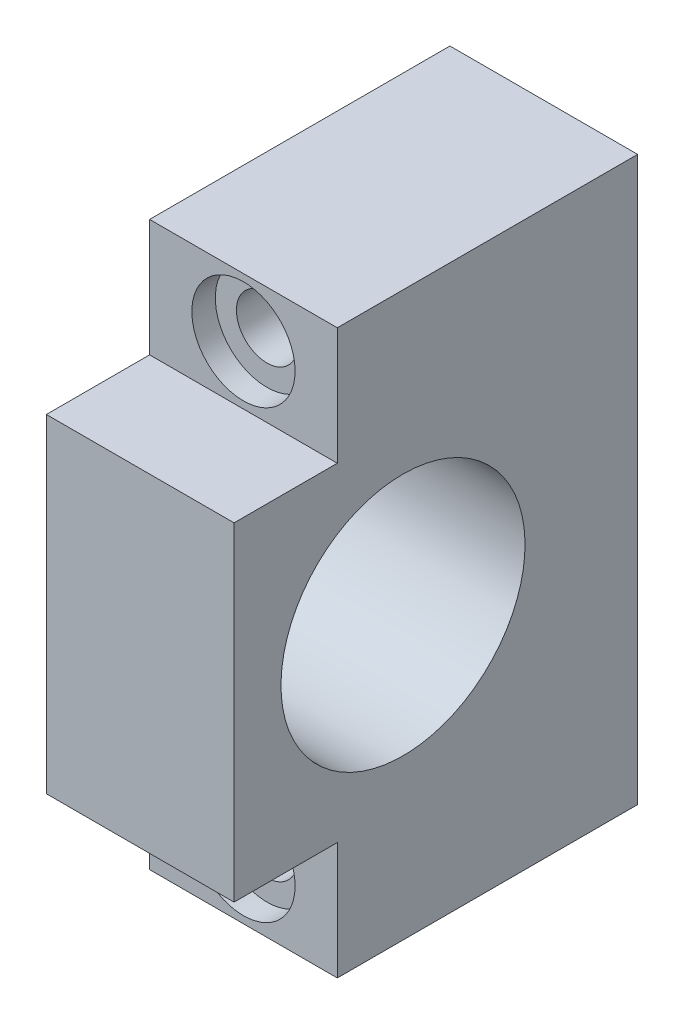
ISO-10303-21;
HEADER;
FILE_DESCRIPTION(('STEP AP214'),'2;1');
FILE_NAME('part.step','',(''),(''),'','','');
FILE_SCHEMA(('AUTOMOTIVE_DESIGN { 1 0 10303 214 1 1 1 1 }'));
ENDSEC;
DATA;
#1=APPLICATION_CONTEXT('core data for automotive mechanical design processes');
#2=APPLICATION_PROTOCOL_DEFINITION('international standard','automotive_design',2000,#1);
#3=PRODUCT_CONTEXT('',#1,'mechanical');
#4=PRODUCT('Part','Part','',(#3));
#5=PRODUCT_RELATED_PRODUCT_CATEGORY('part','',(#4));
#6=PRODUCT_DEFINITION_FORMATION('','',#4);
#7=PRODUCT_DEFINITION_CONTEXT('part definition',#1,'design');
#8=PRODUCT_DEFINITION('design','',#6,#7);
#9=PRODUCT_DEFINITION_SHAPE('','',#8);
#10=(LENGTH_UNIT() NAMED_UNIT(*) SI_UNIT(.MILLI.,.METRE.));
#11=(NAMED_UNIT(*) PLANE_ANGLE_UNIT() SI_UNIT($,.RADIAN.));
#12=(NAMED_UNIT(*) SI_UNIT($,.STERADIAN.) SOLID_ANGLE_UNIT());
#13=UNCERTAINTY_MEASURE_WITH_UNIT(LENGTH_MEASURE(1.E-05),#10,'distance_accuracy_value','');
#14=(GEOMETRIC_REPRESENTATION_CONTEXT(3) GLOBAL_UNCERTAINTY_ASSIGNED_CONTEXT((#13)) GLOBAL_UNIT_ASSIGNED_CONTEXT((#10,
#11,#12)) REPRESENTATION_CONTEXT('',''));
#15=CARTESIAN_POINT('',(0.,0.,0.));
#16=DIRECTION('',(0.,0.,1.));
#17=DIRECTION('',(1.,0.,0.));
#18=AXIS2_PLACEMENT_3D('',#15,#16,#17);
#19=CARTESIAN_POINT('',(0.,-23.75,0.));
#20=DIRECTION('',(0.,0.,1.));
#21=DIRECTION('',(1.,0.,0.));
#22=AXIS2_PLACEMENT_3D('',#19,#20,#21);
#23=CYLINDRICAL_SURFACE('',#22,3.25);
#24=CARTESIAN_POINT('',(0.,-23.75,0.));
#25=DIRECTION('',(0.,0.,1.));
#26=DIRECTION('',(1.,0.,0.));
#27=AXIS2_PLACEMENT_3D('',#24,#25,#26);
#28=CIRCLE('',#27,3.25);
#29=CARTESIAN_POINT('',(3.25,-23.75,0.));
#30=VERTEX_POINT('',#29);
#31=EDGE_CURVE('E178',#30,#30,#28,.T.);
#32=ORIENTED_EDGE('',*,*,#31,.F.);
#33=EDGE_LOOP('',(#32));
#34=FACE_BOUND('',#33,.T.);
#35=CARTESIAN_POINT('',(0.,-23.75,29.5));
#36=DIRECTION('',(0.,0.,1.));
#37=DIRECTION('',(1.,0.,0.));
#38=AXIS2_PLACEMENT_3D('',#35,#36,#37);
#39=CIRCLE('',#38,3.25);
#40=CARTESIAN_POINT('',(3.25,-23.75,29.5));
#41=VERTEX_POINT('',#40);
#42=EDGE_CURVE('E49',#41,#41,#39,.F.);
#43=ORIENTED_EDGE('',*,*,#42,.F.);
#44=EDGE_LOOP('',(#43));
#45=FACE_BOUND('',#44,.T.);
#46=ADVANCED_FACE('F45',(#34,#45),#23,.F.);
#47=CARTESIAN_POINT('',(0.,23.75,0.));
#48=DIRECTION('',(0.,0.,1.));
#49=DIRECTION('',(1.,0.,0.));
#50=AXIS2_PLACEMENT_3D('',#47,#48,#49);
#51=CYLINDRICAL_SURFACE('',#50,3.25);
#52=CARTESIAN_POINT('',(0.,23.75,0.));
#53=DIRECTION('',(0.,0.,1.));
#54=DIRECTION('',(1.,0.,0.));
#55=AXIS2_PLACEMENT_3D('',#52,#53,#54);
#56=CIRCLE('',#55,3.25);
#57=CARTESIAN_POINT('',(3.25,23.75,0.));
#58=VERTEX_POINT('',#57);
#59=EDGE_CURVE('E156',#58,#58,#56,.T.);
#60=ORIENTED_EDGE('',*,*,#59,.F.);
#61=EDGE_LOOP('',(#60));
#62=FACE_BOUND('',#61,.T.);
#63=CARTESIAN_POINT('',(0.,23.75,29.5));
#64=DIRECTION('',(0.,0.,1.));
#65=DIRECTION('',(1.,0.,0.));
#66=AXIS2_PLACEMENT_3D('',#63,#64,#65);
#67=CIRCLE('',#66,3.25);
#68=CARTESIAN_POINT('',(3.25,23.75,29.5));
#69=VERTEX_POINT('',#68);
#70=EDGE_CURVE('E147',#69,#69,#67,.F.);
#71=ORIENTED_EDGE('',*,*,#70,.F.);
#72=EDGE_LOOP('',(#71));
#73=FACE_BOUND('',#72,.T.);
#74=ADVANCED_FACE('F258',(#62,#73),#51,.F.);
#75=CARTESIAN_POINT('',(-10.,30.,43.));
#76=DIRECTION('',(0.,-1.,0.));
#77=DIRECTION('',(0.,0.,-1.));
#78=AXIS2_PLACEMENT_3D('',#75,#76,#77);
#79=PLANE('',#78);
#80=DIRECTION('',(-1.,0.,0.));
#81=VECTOR('',#80,1.);
#82=CARTESIAN_POINT('',(-10.,30.,32.));
#83=LINE('',#82,#81);
#84=CARTESIAN_POINT('',(10.,30.,32.));
#85=VERTEX_POINT('',#84);
#86=CARTESIAN_POINT('',(-10.,30.,32.));
#87=VERTEX_POINT('',#86);
#88=EDGE_CURVE('E201',#85,#87,#83,.T.);
#89=ORIENTED_EDGE('',*,*,#88,.F.);
#90=DIRECTION('',(0.,0.,-1.));
#91=VECTOR('',#90,1.);
#92=CARTESIAN_POINT('',(9.99999999999999,30.,43.));
#93=LINE('',#92,#91);
#94=CARTESIAN_POINT('',(9.99999999999999,30.,0.));
#95=VERTEX_POINT('',#94);
#96=EDGE_CURVE('E11',#85,#95,#93,.T.);
#97=ORIENTED_EDGE('',*,*,#96,.T.);
#98=DIRECTION('',(-1.,0.,0.));
#99=VECTOR('',#98,1.);
#100=CARTESIAN_POINT('',(-10.,30.,0.));
#101=LINE('',#100,#99);
#102=CARTESIAN_POINT('',(-10.,30.,0.));
#103=VERTEX_POINT('',#102);
#104=EDGE_CURVE('E231',#95,#103,#101,.T.);
#105=ORIENTED_EDGE('',*,*,#104,.T.);
#106=DIRECTION('',(0.,0.,-1.));
#107=VECTOR('',#106,1.);
#108=CARTESIAN_POINT('',(-10.,30.,43.));
#109=LINE('',#108,#107);
#110=EDGE_CURVE('E55',#87,#103,#109,.T.);
#111=ORIENTED_EDGE('',*,*,#110,.F.);
#112=EDGE_LOOP('',(#89,#97,#105,#111));
#113=FACE_BOUND('',#112,.T.);
#114=ADVANCED_FACE('F256',(#113),#79,.F.);
#115=CARTESIAN_POINT('',(9.99999999999999,30.,43.));
#116=DIRECTION('',(-1.,0.,0.));
#117=DIRECTION('',(0.,-1.,0.));
#118=AXIS2_PLACEMENT_3D('',#115,#116,#117);
#119=PLANE('',#118);
#120=CARTESIAN_POINT('',(10.,0.,25.));
#121=DIRECTION('',(1.,0.,0.));
#122=DIRECTION('',(0.,1.,0.));
#123=AXIS2_PLACEMENT_3D('',#120,#121,#122);
#124=CIRCLE('',#123,13.);
#125=CARTESIAN_POINT('',(10.,13.,25.));
#126=VERTEX_POINT('',#125);
#127=EDGE_CURVE('E167',#126,#126,#124,.T.);
#128=ORIENTED_EDGE('',*,*,#127,.F.);
#129=EDGE_LOOP('',(#128));
#130=FACE_BOUND('',#129,.T.);
#131=DIRECTION('',(0.,1.,0.));
#132=VECTOR('',#131,1.);
#133=CARTESIAN_POINT('',(9.99999999999999,30.,43.));
#134=LINE('',#133,#132);
#135=CARTESIAN_POINT('',(10.,-17.5,43.));
#136=VERTEX_POINT('',#135);
#137=CARTESIAN_POINT('',(10.,17.5,43.));
#138=VERTEX_POINT('',#137);
#139=EDGE_CURVE('E220',#136,#138,#134,.T.);
#140=ORIENTED_EDGE('',*,*,#139,.F.);
#141=DIRECTION('',(0.,0.,1.));
#142=VECTOR('',#141,1.);
#143=CARTESIAN_POINT('',(10.,-17.5,32.));
#144=LINE('',#143,#142);
#145=CARTESIAN_POINT('',(10.,-17.5,32.));
#146=VERTEX_POINT('',#145);
#147=EDGE_CURVE('E71',#146,#136,#144,.T.);
#148=ORIENTED_EDGE('',*,*,#147,.F.);
#149=DIRECTION('',(0.,1.,0.));
#150=VECTOR('',#149,1.);
#151=CARTESIAN_POINT('',(10.,-30.,32.));
#152=LINE('',#151,#150);
#153=CARTESIAN_POINT('',(10.,-30.,32.));
#154=VERTEX_POINT('',#153);
#155=EDGE_CURVE('E133',#154,#146,#152,.T.);
#156=ORIENTED_EDGE('',*,*,#155,.F.);
#157=DIRECTION('',(0.,0.,-1.));
#158=VECTOR('',#157,1.);
#159=CARTESIAN_POINT('',(10.,-30.,43.));
#160=LINE('',#159,#158);
#161=CARTESIAN_POINT('',(10.,-30.,0.));
#162=VERTEX_POINT('',#161);
#163=EDGE_CURVE('E131',#154,#162,#160,.T.);
#164=ORIENTED_EDGE('',*,*,#163,.T.);
#165=DIRECTION('',(0.,1.,0.));
#166=VECTOR('',#165,1.);
#167=CARTESIAN_POINT('',(9.99999999999999,30.,0.));
#168=LINE('',#167,#166);
#169=EDGE_CURVE('E196',#162,#95,#168,.T.);
#170=ORIENTED_EDGE('',*,*,#169,.T.);
#171=ORIENTED_EDGE('',*,*,#96,.F.);
#172=DIRECTION('',(0.,1.,0.));
#173=VECTOR('',#172,1.);
#174=CARTESIAN_POINT('',(10.,30.,32.));
#175=LINE('',#174,#173);
#176=CARTESIAN_POINT('',(10.,17.5,32.));
#177=VERTEX_POINT('',#176);
#178=EDGE_CURVE('E210',#177,#85,#175,.T.);
#179=ORIENTED_EDGE('',*,*,#178,.F.);
#180=DIRECTION('',(0.,0.,1.));
#181=VECTOR('',#180,1.);
#182=CARTESIAN_POINT('',(10.,17.5,32.));
#183=LINE('',#182,#181);
#184=EDGE_CURVE('E182',#177,#138,#183,.T.);
#185=ORIENTED_EDGE('',*,*,#184,.T.);
#186=EDGE_LOOP('',(#140,#148,#156,#164,#170,#171,#179,#185));
#187=FACE_BOUND('',#186,.T.);
#188=ADVANCED_FACE('F47',(#130,#187),#119,.F.);
#189=CARTESIAN_POINT('',(-10.,30.,43.));
#190=DIRECTION('',(1.,0.,0.));
#191=DIRECTION('',(0.,1.,0.));
#192=AXIS2_PLACEMENT_3D('',#189,#190,#191);
#193=PLANE('',#192);
#194=CARTESIAN_POINT('',(-10.,0.,25.));
#195=DIRECTION('',(1.,0.,0.));
#196=DIRECTION('',(0.,1.,0.));
#197=AXIS2_PLACEMENT_3D('',#194,#195,#196);
#198=CIRCLE('',#197,13.);
#199=CARTESIAN_POINT('',(-10.,13.,25.));
#200=VERTEX_POINT('',#199);
#201=EDGE_CURVE('E177',#200,#200,#198,.T.);
#202=ORIENTED_EDGE('',*,*,#201,.T.);
#203=EDGE_LOOP('',(#202));
#204=FACE_BOUND('',#203,.T.);
#205=DIRECTION('',(0.,-1.,0.));
#206=VECTOR('',#205,1.);
#207=CARTESIAN_POINT('',(-10.,-30.,32.));
#208=LINE('',#207,#206);
#209=CARTESIAN_POINT('',(-10.,-17.5,32.));
#210=VERTEX_POINT('',#209);
#211=CARTESIAN_POINT('',(-10.,-30.,32.));
#212=VERTEX_POINT('',#211);
#213=EDGE_CURVE('E113',#210,#212,#208,.T.);
#214=ORIENTED_EDGE('',*,*,#213,.F.);
#215=DIRECTION('',(0.,0.,1.));
#216=VECTOR('',#215,1.);
#217=CARTESIAN_POINT('',(-10.,-17.5,32.));
#218=LINE('',#217,#216);
#219=CARTESIAN_POINT('',(-10.,-17.5,43.));
#220=VERTEX_POINT('',#219);
#221=EDGE_CURVE('E193',#210,#220,#218,.T.);
#222=ORIENTED_EDGE('',*,*,#221,.T.);
#223=DIRECTION('',(0.,-1.,0.));
#224=VECTOR('',#223,1.);
#225=CARTESIAN_POINT('',(-10.,30.,43.));
#226=LINE('',#225,#224);
#227=CARTESIAN_POINT('',(-10.,17.5,43.));
#228=VERTEX_POINT('',#227);
#229=EDGE_CURVE('E144',#228,#220,#226,.T.);
#230=ORIENTED_EDGE('',*,*,#229,.F.);
#231=DIRECTION('',(0.,0.,1.));
#232=VECTOR('',#231,1.);
#233=CARTESIAN_POINT('',(-10.,17.5,32.));
#234=LINE('',#233,#232);
#235=CARTESIAN_POINT('',(-10.,17.5,32.));
#236=VERTEX_POINT('',#235);
#237=EDGE_CURVE('E63',#236,#228,#234,.T.);
#238=ORIENTED_EDGE('',*,*,#237,.F.);
#239=DIRECTION('',(0.,-1.,0.));
#240=VECTOR('',#239,1.);
#241=CARTESIAN_POINT('',(-10.,30.,32.));
#242=LINE('',#241,#240);
#243=EDGE_CURVE('E207',#87,#236,#242,.T.);
#244=ORIENTED_EDGE('',*,*,#243,.F.);
#245=ORIENTED_EDGE('',*,*,#110,.T.);
#246=DIRECTION('',(0.,-1.,0.));
#247=VECTOR('',#246,1.);
#248=CARTESIAN_POINT('',(-10.,30.,0.));
#249=LINE('',#248,#247);
#250=CARTESIAN_POINT('',(-10.,-30.,0.));
#251=VERTEX_POINT('',#250);
#252=EDGE_CURVE('E137',#103,#251,#249,.T.);
#253=ORIENTED_EDGE('',*,*,#252,.T.);
#254=DIRECTION('',(0.,0.,-1.));
#255=VECTOR('',#254,1.);
#256=CARTESIAN_POINT('',(-10.,-30.,43.));
#257=LINE('',#256,#255);
#258=EDGE_CURVE('E129',#212,#251,#257,.T.);
#259=ORIENTED_EDGE('',*,*,#258,.F.);
#260=EDGE_LOOP('',(#214,#222,#230,#238,#244,#245,#253,#259));
#261=FACE_BOUND('',#260,.T.);
#262=ADVANCED_FACE('F135',(#204,#261),#193,.F.);
#263=CARTESIAN_POINT('',(-10.,-30.,43.));
#264=DIRECTION('',(0.,1.,0.));
#265=DIRECTION('',(0.,0.,1.));
#266=AXIS2_PLACEMENT_3D('',#263,#264,#265);
#267=PLANE('',#266);
#268=ORIENTED_EDGE('',*,*,#163,.F.);
#269=DIRECTION('',(1.,0.,0.));
#270=VECTOR('',#269,1.);
#271=CARTESIAN_POINT('',(-10.,-30.,32.));
#272=LINE('',#271,#270);
#273=EDGE_CURVE('E116',#212,#154,#272,.T.);
#274=ORIENTED_EDGE('',*,*,#273,.F.);
#275=ORIENTED_EDGE('',*,*,#258,.T.);
#276=DIRECTION('',(1.,0.,0.));
#277=VECTOR('',#276,1.);
#278=CARTESIAN_POINT('',(-10.,-30.,0.));
#279=LINE('',#278,#277);
#280=EDGE_CURVE('E224',#251,#162,#279,.T.);
#281=ORIENTED_EDGE('',*,*,#280,.T.);
#282=EDGE_LOOP('',(#268,#274,#275,#281));
#283=FACE_BOUND('',#282,.T.);
#284=ADVANCED_FACE('F127',(#283),#267,.F.);
#285=CARTESIAN_POINT('',(0.,0.,43.));
#286=DIRECTION('',(0.,0.,1.));
#287=DIRECTION('',(1.,0.,0.));
#288=AXIS2_PLACEMENT_3D('',#285,#286,#287);
#289=PLANE('',#288);
#290=DIRECTION('',(-1.,0.,0.));
#291=VECTOR('',#290,1.);
#292=CARTESIAN_POINT('',(-10.,-17.5,43.));
#293=LINE('',#292,#291);
#294=EDGE_CURVE('E123',#136,#220,#293,.T.);
#295=ORIENTED_EDGE('',*,*,#294,.F.);
#296=ORIENTED_EDGE('',*,*,#139,.T.);
#297=DIRECTION('',(1.,0.,0.));
#298=VECTOR('',#297,1.);
#299=CARTESIAN_POINT('',(-10.,17.5,43.));
#300=LINE('',#299,#298);
#301=EDGE_CURVE('E192',#228,#138,#300,.T.);
#302=ORIENTED_EDGE('',*,*,#301,.F.);
#303=ORIENTED_EDGE('',*,*,#229,.T.);
#304=EDGE_LOOP('',(#295,#296,#302,#303));
#305=FACE_BOUND('',#304,.T.);
#306=ADVANCED_FACE('F248',(#305),#289,.T.);
#307=CARTESIAN_POINT('',(0.,0.,0.));
#308=DIRECTION('',(0.,0.,1.));
#309=DIRECTION('',(1.,0.,0.));
#310=AXIS2_PLACEMENT_3D('',#307,#308,#309);
#311=PLANE('',#310);
#312=ORIENTED_EDGE('',*,*,#31,.T.);
#313=EDGE_LOOP('',(#312));
#314=FACE_BOUND('',#313,.T.);
#315=ORIENTED_EDGE('',*,*,#59,.T.);
#316=EDGE_LOOP('',(#315));
#317=FACE_BOUND('',#316,.T.);
#318=ORIENTED_EDGE('',*,*,#169,.F.);
#319=ORIENTED_EDGE('',*,*,#280,.F.);
#320=ORIENTED_EDGE('',*,*,#252,.F.);
#321=ORIENTED_EDGE('',*,*,#104,.F.);
#322=EDGE_LOOP('',(#318,#319,#320,#321));
#323=FACE_BOUND('',#322,.T.);
#324=ADVANCED_FACE('F240',(#314,#317,#323),#311,.F.);
#325=CARTESIAN_POINT('',(-10.,17.5,32.));
#326=DIRECTION('',(0.,-1.,0.));
#327=DIRECTION('',(1.,0.,0.));
#328=AXIS2_PLACEMENT_3D('',#325,#326,#327);
#329=PLANE('',#328);
#330=ORIENTED_EDGE('',*,*,#301,.T.);
#331=ORIENTED_EDGE('',*,*,#184,.F.);
#332=DIRECTION('',(1.,0.,0.));
#333=VECTOR('',#332,1.);
#334=CARTESIAN_POINT('',(-10.,17.5,32.));
#335=LINE('',#334,#333);
#336=EDGE_CURVE('E213',#236,#177,#335,.T.);
#337=ORIENTED_EDGE('',*,*,#336,.F.);
#338=ORIENTED_EDGE('',*,*,#237,.T.);
#339=EDGE_LOOP('',(#330,#331,#337,#338));
#340=FACE_BOUND('',#339,.T.);
#341=ADVANCED_FACE('F249',(#340),#329,.F.);
#342=CARTESIAN_POINT('',(0.,0.,32.));
#343=DIRECTION('',(0.,0.,1.));
#344=DIRECTION('',(1.,0.,0.));
#345=AXIS2_PLACEMENT_3D('',#342,#343,#344);
#346=PLANE('',#345);
#347=CARTESIAN_POINT('',(0.,23.75,32.));
#348=DIRECTION('',(0.,0.,1.));
#349=DIRECTION('',(1.,0.,0.));
#350=AXIS2_PLACEMENT_3D('',#347,#348,#349);
#351=CIRCLE('',#350,5.5);
#352=CARTESIAN_POINT('',(5.5,23.75,32.));
#353=VERTEX_POINT('',#352);
#354=EDGE_CURVE('E164',#353,#353,#351,.T.);
#355=ORIENTED_EDGE('',*,*,#354,.F.);
#356=EDGE_LOOP('',(#355));
#357=FACE_BOUND('',#356,.T.);
#358=ORIENTED_EDGE('',*,*,#243,.T.);
#359=ORIENTED_EDGE('',*,*,#336,.T.);
#360=ORIENTED_EDGE('',*,*,#178,.T.);
#361=ORIENTED_EDGE('',*,*,#88,.T.);
#362=EDGE_LOOP('',(#358,#359,#360,#361));
#363=FACE_BOUND('',#362,.T.);
#364=ADVANCED_FACE('F252',(#357,#363),#346,.T.);
#365=CARTESIAN_POINT('',(-10.,-17.5,32.));
#366=DIRECTION('',(0.,1.,0.));
#367=DIRECTION('',(0.,0.,1.));
#368=AXIS2_PLACEMENT_3D('',#365,#366,#367);
#369=PLANE('',#368);
#370=ORIENTED_EDGE('',*,*,#294,.T.);
#371=ORIENTED_EDGE('',*,*,#221,.F.);
#372=DIRECTION('',(-1.,0.,0.));
#373=VECTOR('',#372,1.);
#374=CARTESIAN_POINT('',(-10.,-17.5,32.));
#375=LINE('',#374,#373);
#376=EDGE_CURVE('E118',#146,#210,#375,.T.);
#377=ORIENTED_EDGE('',*,*,#376,.F.);
#378=ORIENTED_EDGE('',*,*,#147,.T.);
#379=EDGE_LOOP('',(#370,#371,#377,#378));
#380=FACE_BOUND('',#379,.T.);
#381=ADVANCED_FACE('F245',(#380),#369,.F.);
#382=CARTESIAN_POINT('',(0.,0.,32.));
#383=DIRECTION('',(0.,0.,-1.));
#384=DIRECTION('',(-1.,0.,0.));
#385=AXIS2_PLACEMENT_3D('',#382,#383,#384);
#386=PLANE('',#385);
#387=CARTESIAN_POINT('',(0.,-23.75,32.));
#388=DIRECTION('',(0.,0.,1.));
#389=DIRECTION('',(1.,0.,0.));
#390=AXIS2_PLACEMENT_3D('',#387,#388,#389);
#391=CIRCLE('',#390,5.5);
#392=CARTESIAN_POINT('',(5.5,-23.75,32.));
#393=VERTEX_POINT('',#392);
#394=EDGE_CURVE('E158',#393,#393,#391,.T.);
#395=ORIENTED_EDGE('',*,*,#394,.F.);
#396=EDGE_LOOP('',(#395));
#397=FACE_BOUND('',#396,.T.);
#398=ORIENTED_EDGE('',*,*,#213,.T.);
#399=ORIENTED_EDGE('',*,*,#273,.T.);
#400=ORIENTED_EDGE('',*,*,#155,.T.);
#401=ORIENTED_EDGE('',*,*,#376,.T.);
#402=EDGE_LOOP('',(#398,#399,#400,#401));
#403=FACE_BOUND('',#402,.T.);
#404=ADVANCED_FACE('F115',(#397,#403),#386,.F.);
#405=CARTESIAN_POINT('',(0.,23.75,29.5));
#406=DIRECTION('',(0.,0.,1.));
#407=DIRECTION('',(1.,0.,0.));
#408=AXIS2_PLACEMENT_3D('',#405,#406,#407);
#409=PLANE('',#408);
#410=CARTESIAN_POINT('',(0.,23.75,29.5));
#411=DIRECTION('',(0.,0.,1.));
#412=DIRECTION('',(1.,0.,0.));
#413=AXIS2_PLACEMENT_3D('',#410,#411,#412);
#414=CIRCLE('',#413,5.5);
#415=CARTESIAN_POINT('',(5.5,23.75,29.5));
#416=VERTEX_POINT('',#415);
#417=EDGE_CURVE('E173',#416,#416,#414,.T.);
#418=ORIENTED_EDGE('',*,*,#417,.T.);
#419=EDGE_LOOP('',(#418));
#420=FACE_BOUND('',#419,.T.);
#421=ORIENTED_EDGE('',*,*,#70,.T.);
#422=EDGE_LOOP('',(#421));
#423=FACE_BOUND('',#422,.T.);
#424=ADVANCED_FACE('F277',(#420,#423),#409,.T.);
#425=CARTESIAN_POINT('',(0.,23.75,29.5));
#426=DIRECTION('',(0.,0.,1.));
#427=DIRECTION('',(1.,0.,0.));
#428=AXIS2_PLACEMENT_3D('',#425,#426,#427);
#429=CYLINDRICAL_SURFACE('',#428,5.5);
#430=ORIENTED_EDGE('',*,*,#417,.F.);
#431=EDGE_LOOP('',(#430));
#432=FACE_BOUND('',#431,.T.);
#433=ORIENTED_EDGE('',*,*,#354,.T.);
#434=EDGE_LOOP('',(#433));
#435=FACE_BOUND('',#434,.T.);
#436=ADVANCED_FACE('F318',(#432,#435),#429,.F.);
#437=CARTESIAN_POINT('',(0.,-23.75,29.5));
#438=DIRECTION('',(0.,0.,1.));
#439=DIRECTION('',(1.,0.,0.));
#440=AXIS2_PLACEMENT_3D('',#437,#438,#439);
#441=PLANE('',#440);
#442=CARTESIAN_POINT('',(0.,-23.75,29.5));
#443=DIRECTION('',(0.,0.,1.));
#444=DIRECTION('',(1.,0.,0.));
#445=AXIS2_PLACEMENT_3D('',#442,#443,#444);
#446=CIRCLE('',#445,5.5);
#447=CARTESIAN_POINT('',(5.5,-23.75,29.5));
#448=VERTEX_POINT('',#447);
#449=EDGE_CURVE('E150',#448,#448,#446,.T.);
#450=ORIENTED_EDGE('',*,*,#449,.T.);
#451=EDGE_LOOP('',(#450));
#452=FACE_BOUND('',#451,.T.);
#453=ORIENTED_EDGE('',*,*,#42,.T.);
#454=EDGE_LOOP('',(#453));
#455=FACE_BOUND('',#454,.T.);
#456=ADVANCED_FACE('F313',(#452,#455),#441,.T.);
#457=CARTESIAN_POINT('',(0.,-23.75,29.5));
#458=DIRECTION('',(0.,0.,1.));
#459=DIRECTION('',(1.,0.,0.));
#460=AXIS2_PLACEMENT_3D('',#457,#458,#459);
#461=CYLINDRICAL_SURFACE('',#460,5.5);
#462=ORIENTED_EDGE('',*,*,#449,.F.);
#463=EDGE_LOOP('',(#462));
#464=FACE_BOUND('',#463,.T.);
#465=ORIENTED_EDGE('',*,*,#394,.T.);
#466=EDGE_LOOP('',(#465));
#467=FACE_BOUND('',#466,.T.);
#468=ADVANCED_FACE('F308',(#464,#467),#461,.F.);
#469=CARTESIAN_POINT('',(-10.,0.,25.));
#470=DIRECTION('',(1.,0.,0.));
#471=DIRECTION('',(0.,1.,0.));
#472=AXIS2_PLACEMENT_3D('',#469,#470,#471);
#473=CYLINDRICAL_SURFACE('',#472,13.);
#474=ORIENTED_EDGE('',*,*,#201,.F.);
#475=EDGE_LOOP('',(#474));
#476=FACE_BOUND('',#475,.T.);
#477=ORIENTED_EDGE('',*,*,#127,.T.);
#478=EDGE_LOOP('',(#477));
#479=FACE_BOUND('',#478,.T.);
#480=ADVANCED_FACE('F307',(#476,#479),#473,.F.);
#481=CLOSED_SHELL('',(#46,#74,#114,#188,#262,#284,#306,#324,#341,#364,#381,#404,#424,#436,#456,
#468,#480));
#482=MANIFOLD_SOLID_BREP('B2',#481);
#483=ADVANCED_BREP_SHAPE_REPRESENTATION('',(#18,#482),#14);
#484=SHAPE_DEFINITION_REPRESENTATION(#9,#483);
ENDSEC;
END-ISO-10303-21;
